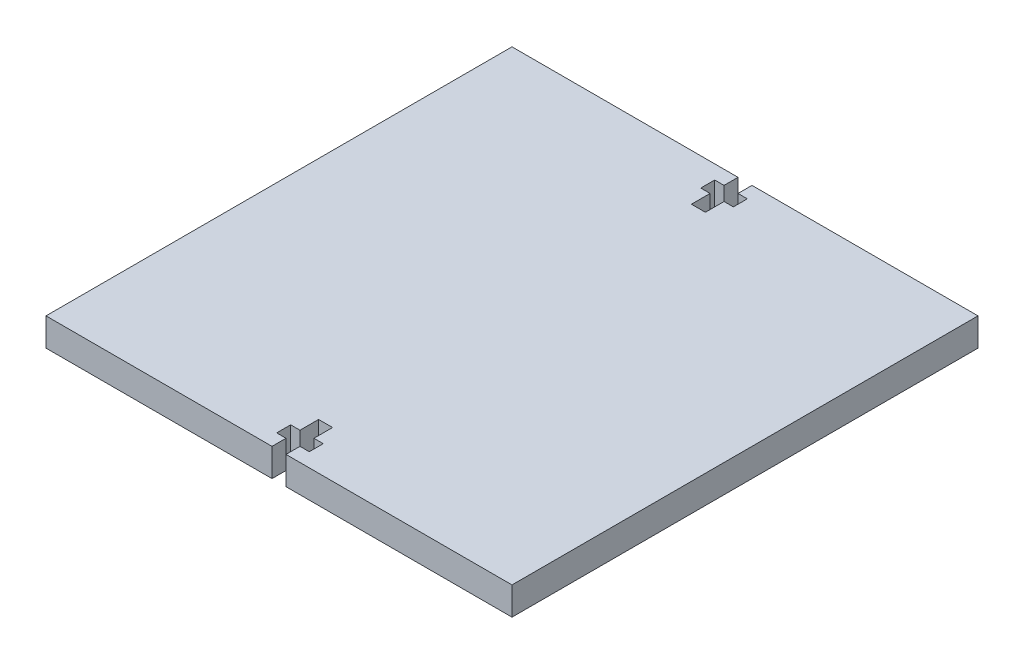
ISO-10303-21;
HEADER;
FILE_DESCRIPTION(('STEP AP214'),'2;1');
FILE_NAME('part.step','',(''),(''),'','','');
FILE_SCHEMA(('AUTOMOTIVE_DESIGN { 1 0 10303 214 1 1 1 1 }'));
ENDSEC;
DATA;
#1=APPLICATION_CONTEXT('core data for automotive mechanical design processes');
#2=APPLICATION_PROTOCOL_DEFINITION('international standard','automotive_design',2000,#1);
#3=PRODUCT_CONTEXT('',#1,'mechanical');
#4=PRODUCT('Part','Part','',(#3));
#5=PRODUCT_RELATED_PRODUCT_CATEGORY('part','',(#4));
#6=PRODUCT_DEFINITION_FORMATION('','',#4);
#7=PRODUCT_DEFINITION_CONTEXT('part definition',#1,'design');
#8=PRODUCT_DEFINITION('design','',#6,#7);
#9=PRODUCT_DEFINITION_SHAPE('','',#8);
#10=(LENGTH_UNIT() NAMED_UNIT(*) SI_UNIT(.MILLI.,.METRE.));
#11=(NAMED_UNIT(*) PLANE_ANGLE_UNIT() SI_UNIT($,.RADIAN.));
#12=(NAMED_UNIT(*) SI_UNIT($,.STERADIAN.) SOLID_ANGLE_UNIT());
#13=UNCERTAINTY_MEASURE_WITH_UNIT(LENGTH_MEASURE(1.E-05),#10,'distance_accuracy_value','');
#14=(GEOMETRIC_REPRESENTATION_CONTEXT(3) GLOBAL_UNCERTAINTY_ASSIGNED_CONTEXT((#13)) GLOBAL_UNIT_ASSIGNED_CONTEXT((#10,
#11,#12)) REPRESENTATION_CONTEXT('',''));
#15=CARTESIAN_POINT('',(0.,0.,0.));
#16=DIRECTION('',(0.,0.,1.));
#17=DIRECTION('',(1.,0.,0.));
#18=AXIS2_PLACEMENT_3D('',#15,#16,#17);
#19=CARTESIAN_POINT('',(0.,6.,0.));
#20=DIRECTION('',(0.,0.,1.));
#21=DIRECTION('',(1.,0.,0.));
#22=AXIS2_PLACEMENT_3D('',#19,#20,#21);
#23=PLANE('',#22);
#24=DIRECTION('',(0.,1.,0.));
#25=VECTOR('',#24,1.);
#26=CARTESIAN_POINT('',(-51.5,0.,0.));
#27=LINE('',#26,#25);
#28=CARTESIAN_POINT('',(-51.5,0.,0.));
#29=VERTEX_POINT('',#28);
#30=CARTESIAN_POINT('',(-51.5,6.,0.));
#31=VERTEX_POINT('',#30);
#32=EDGE_CURVE('E333',#29,#31,#27,.T.);
#33=ORIENTED_EDGE('',*,*,#32,.T.);
#34=DIRECTION('',(-1.,0.,0.));
#35=VECTOR('',#34,1.);
#36=CARTESIAN_POINT('',(0.,6.,0.));
#37=LINE('',#36,#35);
#38=CARTESIAN_POINT('',(-100.,6.,0.));
#39=VERTEX_POINT('',#38);
#40=EDGE_CURVE('E284',#31,#39,#37,.T.);
#41=ORIENTED_EDGE('',*,*,#40,.T.);
#42=DIRECTION('',(0.,-1.,0.));
#43=VECTOR('',#42,1.);
#44=CARTESIAN_POINT('',(-100.,6.,0.));
#45=LINE('',#44,#43);
#46=CARTESIAN_POINT('',(-100.,0.,0.));
#47=VERTEX_POINT('',#46);
#48=EDGE_CURVE('E11',#39,#47,#45,.T.);
#49=ORIENTED_EDGE('',*,*,#48,.T.);
#50=DIRECTION('',(-1.,0.,0.));
#51=VECTOR('',#50,1.);
#52=CARTESIAN_POINT('',(0.,0.,0.));
#53=LINE('',#52,#51);
#54=EDGE_CURVE('E260',#29,#47,#53,.T.);
#55=ORIENTED_EDGE('',*,*,#54,.F.);
#56=EDGE_LOOP('',(#33,#41,#49,#55));
#57=FACE_BOUND('',#56,.T.);
#58=ADVANCED_FACE('F39',(#57),#23,.T.);
#59=CARTESIAN_POINT('',(-100.,6.,-100.));
#60=DIRECTION('',(0.,0.,-1.));
#61=DIRECTION('',(-1.,0.,0.));
#62=AXIS2_PLACEMENT_3D('',#59,#60,#61);
#63=PLANE('',#62);
#64=DIRECTION('',(0.,1.,0.));
#65=VECTOR('',#64,1.);
#66=CARTESIAN_POINT('',(-48.5,0.,-100.));
#67=LINE('',#66,#65);
#68=CARTESIAN_POINT('',(-48.5,0.,-100.));
#69=VERTEX_POINT('',#68);
#70=CARTESIAN_POINT('',(-48.5,6.,-100.));
#71=VERTEX_POINT('',#70);
#72=EDGE_CURVE('E451',#69,#71,#67,.T.);
#73=ORIENTED_EDGE('',*,*,#72,.T.);
#74=DIRECTION('',(1.,0.,0.));
#75=VECTOR('',#74,1.);
#76=CARTESIAN_POINT('',(-100.,6.,-100.));
#77=LINE('',#76,#75);
#78=CARTESIAN_POINT('',(0.,6.,-100.));
#79=VERTEX_POINT('',#78);
#80=EDGE_CURVE('E296',#71,#79,#77,.T.);
#81=ORIENTED_EDGE('',*,*,#80,.T.);
#82=DIRECTION('',(0.,-1.,0.));
#83=VECTOR('',#82,1.);
#84=CARTESIAN_POINT('',(0.,6.,-100.));
#85=LINE('',#84,#83);
#86=CARTESIAN_POINT('',(0.,0.,-100.));
#87=VERTEX_POINT('',#86);
#88=EDGE_CURVE('E271',#79,#87,#85,.T.);
#89=ORIENTED_EDGE('',*,*,#88,.T.);
#90=DIRECTION('',(1.,0.,0.));
#91=VECTOR('',#90,1.);
#92=CARTESIAN_POINT('',(-100.,0.,-100.));
#93=LINE('',#92,#91);
#94=EDGE_CURVE('E255',#69,#87,#93,.T.);
#95=ORIENTED_EDGE('',*,*,#94,.F.);
#96=EDGE_LOOP('',(#73,#81,#89,#95));
#97=FACE_BOUND('',#96,.T.);
#98=ADVANCED_FACE('F566',(#97),#63,.T.);
#99=CARTESIAN_POINT('',(-100.,6.,0.));
#100=DIRECTION('',(-1.,0.,0.));
#101=DIRECTION('',(0.,0.,1.));
#102=AXIS2_PLACEMENT_3D('',#99,#100,#101);
#103=PLANE('',#102);
#104=DIRECTION('',(0.,0.,-1.));
#105=VECTOR('',#104,1.);
#106=CARTESIAN_POINT('',(-100.,0.,0.));
#107=LINE('',#106,#105);
#108=CARTESIAN_POINT('',(-100.,0.,-100.));
#109=VERTEX_POINT('',#108);
#110=EDGE_CURVE('E252',#47,#109,#107,.T.);
#111=ORIENTED_EDGE('',*,*,#110,.F.);
#112=ORIENTED_EDGE('',*,*,#48,.F.);
#113=DIRECTION('',(0.,0.,-1.));
#114=VECTOR('',#113,1.);
#115=CARTESIAN_POINT('',(-100.,6.,0.));
#116=LINE('',#115,#114);
#117=CARTESIAN_POINT('',(-100.,6.,-100.));
#118=VERTEX_POINT('',#117);
#119=EDGE_CURVE('E268',#39,#118,#116,.T.);
#120=ORIENTED_EDGE('',*,*,#119,.T.);
#121=DIRECTION('',(0.,-1.,0.));
#122=VECTOR('',#121,1.);
#123=CARTESIAN_POINT('',(-100.,6.,-100.));
#124=LINE('',#123,#122);
#125=EDGE_CURVE('E43',#118,#109,#124,.T.);
#126=ORIENTED_EDGE('',*,*,#125,.T.);
#127=EDGE_LOOP('',(#111,#112,#120,#126));
#128=FACE_BOUND('',#127,.T.);
#129=ADVANCED_FACE('F41',(#128),#103,.T.);
#130=DIRECTION('',(0.,1.,0.));
#131=VECTOR('',#130,1.);
#132=CARTESIAN_POINT('',(-48.5,0.,0.));
#133=LINE('',#132,#131);
#134=CARTESIAN_POINT('',(-48.5,0.,0.));
#135=VERTEX_POINT('',#134);
#136=CARTESIAN_POINT('',(-48.5,6.,0.));
#137=VERTEX_POINT('',#136);
#138=EDGE_CURVE('E299',#135,#137,#133,.T.);
#139=ORIENTED_EDGE('',*,*,#138,.F.);
#140=CARTESIAN_POINT('',(0.,0.,0.));
#141=VERTEX_POINT('',#140);
#142=EDGE_CURVE('E265',#141,#135,#53,.T.);
#143=ORIENTED_EDGE('',*,*,#142,.F.);
#144=DIRECTION('',(0.,-1.,0.));
#145=VECTOR('',#144,1.);
#146=CARTESIAN_POINT('',(0.,6.,0.));
#147=LINE('',#146,#145);
#148=CARTESIAN_POINT('',(0.,6.,0.));
#149=VERTEX_POINT('',#148);
#150=EDGE_CURVE('E49',#149,#141,#147,.T.);
#151=ORIENTED_EDGE('',*,*,#150,.F.);
#152=EDGE_CURVE('E279',#149,#137,#37,.T.);
#153=ORIENTED_EDGE('',*,*,#152,.T.);
#154=EDGE_LOOP('',(#139,#143,#151,#153));
#155=FACE_BOUND('',#154,.T.);
#156=ADVANCED_FACE('F581',(#155),#23,.T.);
#157=CARTESIAN_POINT('',(0.,6.,-100.));
#158=DIRECTION('',(1.,0.,0.));
#159=DIRECTION('',(0.,0.,-1.));
#160=AXIS2_PLACEMENT_3D('',#157,#158,#159);
#161=PLANE('',#160);
#162=DIRECTION('',(0.,0.,1.));
#163=VECTOR('',#162,1.);
#164=CARTESIAN_POINT('',(0.,0.,-100.));
#165=LINE('',#164,#163);
#166=EDGE_CURVE('E254',#87,#141,#165,.T.);
#167=ORIENTED_EDGE('',*,*,#166,.F.);
#168=ORIENTED_EDGE('',*,*,#88,.F.);
#169=DIRECTION('',(0.,0.,1.));
#170=VECTOR('',#169,1.);
#171=CARTESIAN_POINT('',(0.,6.,-100.));
#172=LINE('',#171,#170);
#173=EDGE_CURVE('E289',#79,#149,#172,.T.);
#174=ORIENTED_EDGE('',*,*,#173,.T.);
#175=ORIENTED_EDGE('',*,*,#150,.T.);
#176=EDGE_LOOP('',(#167,#168,#174,#175));
#177=FACE_BOUND('',#176,.T.);
#178=ADVANCED_FACE('F586',(#177),#161,.T.);
#179=DIRECTION('',(0.,1.,0.));
#180=VECTOR('',#179,1.);
#181=CARTESIAN_POINT('',(-51.5,0.,-100.));
#182=LINE('',#181,#180);
#183=CARTESIAN_POINT('',(-51.5,0.,-100.));
#184=VERTEX_POINT('',#183);
#185=CARTESIAN_POINT('',(-51.5,6.,-100.));
#186=VERTEX_POINT('',#185);
#187=EDGE_CURVE('E230',#184,#186,#182,.T.);
#188=ORIENTED_EDGE('',*,*,#187,.F.);
#189=EDGE_CURVE('E242',#109,#184,#93,.T.);
#190=ORIENTED_EDGE('',*,*,#189,.F.);
#191=ORIENTED_EDGE('',*,*,#125,.F.);
#192=EDGE_CURVE('E245',#118,#186,#77,.T.);
#193=ORIENTED_EDGE('',*,*,#192,.T.);
#194=EDGE_LOOP('',(#188,#190,#191,#193));
#195=FACE_BOUND('',#194,.T.);
#196=ADVANCED_FACE('F241',(#195),#63,.T.);
#197=CARTESIAN_POINT('',(0.,6.,0.));
#198=DIRECTION('',(0.,-1.,0.));
#199=DIRECTION('',(0.,0.,-1.));
#200=AXIS2_PLACEMENT_3D('',#197,#198,#199);
#201=PLANE('',#200);
#202=ORIENTED_EDGE('',*,*,#80,.F.);
#203=DIRECTION('',(0.,0.,-1.));
#204=VECTOR('',#203,1.);
#205=CARTESIAN_POINT('',(-48.5,6.,-100.));
#206=LINE('',#205,#204);
#207=CARTESIAN_POINT('',(-48.5,6.,-97.));
#208=VERTEX_POINT('',#207);
#209=EDGE_CURVE('E236',#208,#71,#206,.T.);
#210=ORIENTED_EDGE('',*,*,#209,.F.);
#211=DIRECTION('',(-1.,0.,0.));
#212=VECTOR('',#211,1.);
#213=CARTESIAN_POINT('',(-48.5,6.,-97.));
#214=LINE('',#213,#212);
#215=CARTESIAN_POINT('',(-46.5,6.,-97.));
#216=VERTEX_POINT('',#215);
#217=EDGE_CURVE('E457',#216,#208,#214,.T.);
#218=ORIENTED_EDGE('',*,*,#217,.F.);
#219=DIRECTION('',(0.,0.,-1.));
#220=VECTOR('',#219,1.);
#221=CARTESIAN_POINT('',(-46.5,6.,-97.));
#222=LINE('',#221,#220);
#223=CARTESIAN_POINT('',(-46.5,6.,-94.));
#224=VERTEX_POINT('',#223);
#225=EDGE_CURVE('E461',#224,#216,#222,.T.);
#226=ORIENTED_EDGE('',*,*,#225,.F.);
#227=DIRECTION('',(1.,0.,0.));
#228=VECTOR('',#227,1.);
#229=CARTESIAN_POINT('',(-46.5,6.,-94.));
#230=LINE('',#229,#228);
#231=CARTESIAN_POINT('',(-48.5,6.,-94.));
#232=VERTEX_POINT('',#231);
#233=EDGE_CURVE('E465',#232,#224,#230,.T.);
#234=ORIENTED_EDGE('',*,*,#233,.F.);
#235=DIRECTION('',(0.,0.,-1.));
#236=VECTOR('',#235,1.);
#237=CARTESIAN_POINT('',(-48.5,6.,-94.));
#238=LINE('',#237,#236);
#239=CARTESIAN_POINT('',(-48.5,6.,-90.));
#240=VERTEX_POINT('',#239);
#241=EDGE_CURVE('E469',#240,#232,#238,.T.);
#242=ORIENTED_EDGE('',*,*,#241,.F.);
#243=DIRECTION('',(1.,0.,0.));
#244=VECTOR('',#243,1.);
#245=CARTESIAN_POINT('',(-48.5,6.,-90.));
#246=LINE('',#245,#244);
#247=CARTESIAN_POINT('',(-51.5,6.,-90.));
#248=VERTEX_POINT('',#247);
#249=EDGE_CURVE('E473',#248,#240,#246,.T.);
#250=ORIENTED_EDGE('',*,*,#249,.F.);
#251=DIRECTION('',(0.,0.,1.));
#252=VECTOR('',#251,1.);
#253=CARTESIAN_POINT('',(-51.5,6.,-94.));
#254=LINE('',#253,#252);
#255=CARTESIAN_POINT('',(-51.5,6.,-94.));
#256=VERTEX_POINT('',#255);
#257=EDGE_CURVE('E477',#256,#248,#254,.T.);
#258=ORIENTED_EDGE('',*,*,#257,.F.);
#259=DIRECTION('',(1.,0.,0.));
#260=VECTOR('',#259,1.);
#261=CARTESIAN_POINT('',(-53.5,6.,-94.));
#262=LINE('',#261,#260);
#263=CARTESIAN_POINT('',(-53.5,6.,-94.));
#264=VERTEX_POINT('',#263);
#265=EDGE_CURVE('E481',#264,#256,#262,.T.);
#266=ORIENTED_EDGE('',*,*,#265,.F.);
#267=DIRECTION('',(0.,0.,1.));
#268=VECTOR('',#267,1.);
#269=CARTESIAN_POINT('',(-53.5,6.,-97.));
#270=LINE('',#269,#268);
#271=CARTESIAN_POINT('',(-53.5,6.,-97.));
#272=VERTEX_POINT('',#271);
#273=EDGE_CURVE('E485',#272,#264,#270,.T.);
#274=ORIENTED_EDGE('',*,*,#273,.F.);
#275=DIRECTION('',(-1.,0.,0.));
#276=VECTOR('',#275,1.);
#277=CARTESIAN_POINT('',(-51.5,6.,-97.));
#278=LINE('',#277,#276);
#279=CARTESIAN_POINT('',(-51.5,6.,-97.));
#280=VERTEX_POINT('',#279);
#281=EDGE_CURVE('E489',#280,#272,#278,.T.);
#282=ORIENTED_EDGE('',*,*,#281,.F.);
#283=DIRECTION('',(0.,0.,1.));
#284=VECTOR('',#283,1.);
#285=CARTESIAN_POINT('',(-51.5,6.,-100.));
#286=LINE('',#285,#284);
#287=EDGE_CURVE('E337',#186,#280,#286,.T.);
#288=ORIENTED_EDGE('',*,*,#287,.F.);
#289=ORIENTED_EDGE('',*,*,#192,.F.);
#290=ORIENTED_EDGE('',*,*,#119,.F.);
#291=ORIENTED_EDGE('',*,*,#40,.F.);
#292=DIRECTION('',(0.,0.,1.));
#293=VECTOR('',#292,1.);
#294=CARTESIAN_POINT('',(-51.5,6.,-2.99999999999999));
#295=LINE('',#294,#293);
#296=CARTESIAN_POINT('',(-51.5,6.,-2.99999999999999));
#297=VERTEX_POINT('',#296);
#298=EDGE_CURVE('E338',#297,#31,#295,.T.);
#299=ORIENTED_EDGE('',*,*,#298,.F.);
#300=DIRECTION('',(1.,0.,0.));
#301=VECTOR('',#300,1.);
#302=CARTESIAN_POINT('',(-53.5,6.,-2.99999999999999));
#303=LINE('',#302,#301);
#304=CARTESIAN_POINT('',(-53.5,6.,-2.99999999999999));
#305=VERTEX_POINT('',#304);
#306=EDGE_CURVE('E342',#305,#297,#303,.T.);
#307=ORIENTED_EDGE('',*,*,#306,.F.);
#308=DIRECTION('',(0.,0.,1.));
#309=VECTOR('',#308,1.);
#310=CARTESIAN_POINT('',(-53.5,6.,-5.99999999999999));
#311=LINE('',#310,#309);
#312=CARTESIAN_POINT('',(-53.5,6.,-5.99999999999999));
#313=VERTEX_POINT('',#312);
#314=EDGE_CURVE('E346',#313,#305,#311,.T.);
#315=ORIENTED_EDGE('',*,*,#314,.F.);
#316=DIRECTION('',(-1.,0.,0.));
#317=VECTOR('',#316,1.);
#318=CARTESIAN_POINT('',(-51.5,6.,-5.99999999999999));
#319=LINE('',#318,#317);
#320=CARTESIAN_POINT('',(-51.5,6.,-5.99999999999999));
#321=VERTEX_POINT('',#320);
#322=EDGE_CURVE('E350',#321,#313,#319,.T.);
#323=ORIENTED_EDGE('',*,*,#322,.F.);
#324=DIRECTION('',(0.,0.,1.));
#325=VECTOR('',#324,1.);
#326=CARTESIAN_POINT('',(-51.5,6.,-10.));
#327=LINE('',#326,#325);
#328=CARTESIAN_POINT('',(-51.5,6.,-10.));
#329=VERTEX_POINT('',#328);
#330=EDGE_CURVE('E354',#329,#321,#327,.T.);
#331=ORIENTED_EDGE('',*,*,#330,.F.);
#332=DIRECTION('',(-1.,0.,0.));
#333=VECTOR('',#332,1.);
#334=CARTESIAN_POINT('',(-50.,6.,-10.));
#335=LINE('',#334,#333);
#336=CARTESIAN_POINT('',(-48.5,6.,-9.99999999999999));
#337=VERTEX_POINT('',#336);
#338=EDGE_CURVE('E358',#337,#329,#335,.T.);
#339=ORIENTED_EDGE('',*,*,#338,.F.);
#340=DIRECTION('',(0.,0.,-1.));
#341=VECTOR('',#340,1.);
#342=CARTESIAN_POINT('',(-48.5,6.,-5.99999999999999));
#343=LINE('',#342,#341);
#344=CARTESIAN_POINT('',(-48.5,6.,-5.99999999999999));
#345=VERTEX_POINT('',#344);
#346=EDGE_CURVE('E362',#345,#337,#343,.T.);
#347=ORIENTED_EDGE('',*,*,#346,.F.);
#348=DIRECTION('',(-1.,0.,0.));
#349=VECTOR('',#348,1.);
#350=CARTESIAN_POINT('',(-46.5,6.,-5.99999999999999));
#351=LINE('',#350,#349);
#352=CARTESIAN_POINT('',(-46.5,6.,-5.99999999999999));
#353=VERTEX_POINT('',#352);
#354=EDGE_CURVE('E366',#353,#345,#351,.T.);
#355=ORIENTED_EDGE('',*,*,#354,.F.);
#356=DIRECTION('',(0.,0.,-1.));
#357=VECTOR('',#356,1.);
#358=CARTESIAN_POINT('',(-46.5,6.,-2.99999999999999));
#359=LINE('',#358,#357);
#360=CARTESIAN_POINT('',(-46.5,6.,-2.99999999999999));
#361=VERTEX_POINT('',#360);
#362=EDGE_CURVE('E370',#361,#353,#359,.T.);
#363=ORIENTED_EDGE('',*,*,#362,.F.);
#364=DIRECTION('',(1.,0.,0.));
#365=VECTOR('',#364,1.);
#366=CARTESIAN_POINT('',(-48.5,6.,-2.99999999999999));
#367=LINE('',#366,#365);
#368=CARTESIAN_POINT('',(-48.5,6.,-2.99999999999999));
#369=VERTEX_POINT('',#368);
#370=EDGE_CURVE('E374',#369,#361,#367,.T.);
#371=ORIENTED_EDGE('',*,*,#370,.F.);
#372=DIRECTION('',(0.,0.,-1.));
#373=VECTOR('',#372,1.);
#374=CARTESIAN_POINT('',(-48.5,6.,0.));
#375=LINE('',#374,#373);
#376=EDGE_CURVE('E378',#137,#369,#375,.T.);
#377=ORIENTED_EDGE('',*,*,#376,.F.);
#378=ORIENTED_EDGE('',*,*,#152,.F.);
#379=ORIENTED_EDGE('',*,*,#173,.F.);
#380=EDGE_LOOP('',(#202,#210,#218,#226,#234,#242,#250,#258,#266,#274,#282,#288,#289,#290,#291,
#299,#307,#315,#323,#331,#339,#347,#355,#363,#371,#377,#378,#379));
#381=FACE_BOUND('',#380,.T.);
#382=ADVANCED_FACE('F570',(#381),#201,.F.);
#383=CARTESIAN_POINT('',(0.,0.,0.));
#384=DIRECTION('',(0.,-1.,0.));
#385=DIRECTION('',(0.,0.,-1.));
#386=AXIS2_PLACEMENT_3D('',#383,#384,#385);
#387=PLANE('',#386);
#388=DIRECTION('',(0.,0.,-1.));
#389=VECTOR('',#388,1.);
#390=CARTESIAN_POINT('',(-48.5,0.,-100.));
#391=LINE('',#390,#389);
#392=CARTESIAN_POINT('',(-48.5,0.,-97.));
#393=VERTEX_POINT('',#392);
#394=EDGE_CURVE('E247',#393,#69,#391,.T.);
#395=ORIENTED_EDGE('',*,*,#394,.T.);
#396=ORIENTED_EDGE('',*,*,#94,.T.);
#397=ORIENTED_EDGE('',*,*,#166,.T.);
#398=ORIENTED_EDGE('',*,*,#142,.T.);
#399=DIRECTION('',(0.,0.,-1.));
#400=VECTOR('',#399,1.);
#401=CARTESIAN_POINT('',(-48.5,0.,0.));
#402=LINE('',#401,#400);
#403=CARTESIAN_POINT('',(-48.5,0.,-2.99999999999999));
#404=VERTEX_POINT('',#403);
#405=EDGE_CURVE('E341',#135,#404,#402,.T.);
#406=ORIENTED_EDGE('',*,*,#405,.T.);
#407=DIRECTION('',(1.,0.,0.));
#408=VECTOR('',#407,1.);
#409=CARTESIAN_POINT('',(-48.5,0.,-2.99999999999999));
#410=LINE('',#409,#408);
#411=CARTESIAN_POINT('',(-46.5,0.,-2.99999999999999));
#412=VERTEX_POINT('',#411);
#413=EDGE_CURVE('E65',#404,#412,#410,.T.);
#414=ORIENTED_EDGE('',*,*,#413,.T.);
#415=DIRECTION('',(0.,0.,-1.));
#416=VECTOR('',#415,1.);
#417=CARTESIAN_POINT('',(-46.5,0.,-2.99999999999999));
#418=LINE('',#417,#416);
#419=CARTESIAN_POINT('',(-46.5,0.,-5.99999999999999));
#420=VERTEX_POINT('',#419);
#421=EDGE_CURVE('E413',#412,#420,#418,.T.);
#422=ORIENTED_EDGE('',*,*,#421,.T.);
#423=DIRECTION('',(-1.,0.,0.));
#424=VECTOR('',#423,1.);
#425=CARTESIAN_POINT('',(-46.5,0.,-5.99999999999999));
#426=LINE('',#425,#424);
#427=CARTESIAN_POINT('',(-48.5,0.,-5.99999999999999));
#428=VERTEX_POINT('',#427);
#429=EDGE_CURVE('E409',#420,#428,#426,.T.);
#430=ORIENTED_EDGE('',*,*,#429,.T.);
#431=DIRECTION('',(0.,0.,-1.));
#432=VECTOR('',#431,1.);
#433=CARTESIAN_POINT('',(-48.5,0.,-5.99999999999999));
#434=LINE('',#433,#432);
#435=CARTESIAN_POINT('',(-48.5,0.,-9.99999999999999));
#436=VERTEX_POINT('',#435);
#437=EDGE_CURVE('E405',#428,#436,#434,.T.);
#438=ORIENTED_EDGE('',*,*,#437,.T.);
#439=DIRECTION('',(-1.,0.,0.));
#440=VECTOR('',#439,1.);
#441=CARTESIAN_POINT('',(-48.5,0.,-9.99999999999999));
#442=LINE('',#441,#440);
#443=CARTESIAN_POINT('',(-51.5,0.,-10.));
#444=VERTEX_POINT('',#443);
#445=EDGE_CURVE('E401',#436,#444,#442,.T.);
#446=ORIENTED_EDGE('',*,*,#445,.T.);
#447=DIRECTION('',(0.,0.,1.));
#448=VECTOR('',#447,1.);
#449=CARTESIAN_POINT('',(-51.5,0.,-10.));
#450=LINE('',#449,#448);
#451=CARTESIAN_POINT('',(-51.5,0.,-5.99999999999999));
#452=VERTEX_POINT('',#451);
#453=EDGE_CURVE('E397',#444,#452,#450,.T.);
#454=ORIENTED_EDGE('',*,*,#453,.T.);
#455=DIRECTION('',(-1.,0.,0.));
#456=VECTOR('',#455,1.);
#457=CARTESIAN_POINT('',(-51.5,0.,-5.99999999999999));
#458=LINE('',#457,#456);
#459=CARTESIAN_POINT('',(-53.5,0.,-5.99999999999999));
#460=VERTEX_POINT('',#459);
#461=EDGE_CURVE('E393',#452,#460,#458,.T.);
#462=ORIENTED_EDGE('',*,*,#461,.T.);
#463=DIRECTION('',(0.,0.,1.));
#464=VECTOR('',#463,1.);
#465=CARTESIAN_POINT('',(-53.5,0.,-5.99999999999999));
#466=LINE('',#465,#464);
#467=CARTESIAN_POINT('',(-53.5,0.,-2.99999999999999));
#468=VERTEX_POINT('',#467);
#469=EDGE_CURVE('E389',#460,#468,#466,.T.);
#470=ORIENTED_EDGE('',*,*,#469,.T.);
#471=DIRECTION('',(1.,0.,0.));
#472=VECTOR('',#471,1.);
#473=CARTESIAN_POINT('',(-53.5,0.,-2.99999999999999));
#474=LINE('',#473,#472);
#475=CARTESIAN_POINT('',(-51.5,0.,-2.99999999999999));
#476=VERTEX_POINT('',#475);
#477=EDGE_CURVE('E385',#468,#476,#474,.T.);
#478=ORIENTED_EDGE('',*,*,#477,.T.);
#479=DIRECTION('',(0.,0.,1.));
#480=VECTOR('',#479,1.);
#481=CARTESIAN_POINT('',(-51.5,0.,-2.99999999999999));
#482=LINE('',#481,#480);
#483=EDGE_CURVE('E303',#476,#29,#482,.T.);
#484=ORIENTED_EDGE('',*,*,#483,.T.);
#485=ORIENTED_EDGE('',*,*,#54,.T.);
#486=ORIENTED_EDGE('',*,*,#110,.T.);
#487=ORIENTED_EDGE('',*,*,#189,.T.);
#488=DIRECTION('',(0.,0.,1.));
#489=VECTOR('',#488,1.);
#490=CARTESIAN_POINT('',(-51.5,0.,-100.));
#491=LINE('',#490,#489);
#492=CARTESIAN_POINT('',(-51.5,0.,-97.));
#493=VERTEX_POINT('',#492);
#494=EDGE_CURVE('E226',#184,#493,#491,.T.);
#495=ORIENTED_EDGE('',*,*,#494,.T.);
#496=DIRECTION('',(-1.,0.,0.));
#497=VECTOR('',#496,1.);
#498=CARTESIAN_POINT('',(-51.5,0.,-97.));
#499=LINE('',#498,#497);
#500=CARTESIAN_POINT('',(-53.5,0.,-97.));
#501=VERTEX_POINT('',#500);
#502=EDGE_CURVE('E57',#493,#501,#499,.T.);
#503=ORIENTED_EDGE('',*,*,#502,.T.);
#504=DIRECTION('',(0.,0.,1.));
#505=VECTOR('',#504,1.);
#506=CARTESIAN_POINT('',(-53.5,0.,-97.));
#507=LINE('',#506,#505);
#508=CARTESIAN_POINT('',(-53.5,0.,-94.));
#509=VERTEX_POINT('',#508);
#510=EDGE_CURVE('E525',#501,#509,#507,.T.);
#511=ORIENTED_EDGE('',*,*,#510,.T.);
#512=DIRECTION('',(1.,0.,0.));
#513=VECTOR('',#512,1.);
#514=CARTESIAN_POINT('',(-53.5,0.,-94.));
#515=LINE('',#514,#513);
#516=CARTESIAN_POINT('',(-51.5,0.,-94.));
#517=VERTEX_POINT('',#516);
#518=EDGE_CURVE('E521',#509,#517,#515,.T.);
#519=ORIENTED_EDGE('',*,*,#518,.T.);
#520=DIRECTION('',(0.,0.,1.));
#521=VECTOR('',#520,1.);
#522=CARTESIAN_POINT('',(-51.5,0.,-94.));
#523=LINE('',#522,#521);
#524=CARTESIAN_POINT('',(-51.5,0.,-90.));
#525=VERTEX_POINT('',#524);
#526=EDGE_CURVE('E517',#517,#525,#523,.T.);
#527=ORIENTED_EDGE('',*,*,#526,.T.);
#528=DIRECTION('',(1.,0.,0.));
#529=VECTOR('',#528,1.);
#530=CARTESIAN_POINT('',(-51.5,0.,-90.));
#531=LINE('',#530,#529);
#532=CARTESIAN_POINT('',(-48.5,0.,-90.));
#533=VERTEX_POINT('',#532);
#534=EDGE_CURVE('E513',#525,#533,#531,.T.);
#535=ORIENTED_EDGE('',*,*,#534,.T.);
#536=DIRECTION('',(0.,0.,-1.));
#537=VECTOR('',#536,1.);
#538=CARTESIAN_POINT('',(-48.5,0.,-94.));
#539=LINE('',#538,#537);
#540=CARTESIAN_POINT('',(-48.5,0.,-94.));
#541=VERTEX_POINT('',#540);
#542=EDGE_CURVE('E509',#533,#541,#539,.T.);
#543=ORIENTED_EDGE('',*,*,#542,.T.);
#544=DIRECTION('',(1.,0.,0.));
#545=VECTOR('',#544,1.);
#546=CARTESIAN_POINT('',(-46.5,0.,-94.));
#547=LINE('',#546,#545);
#548=CARTESIAN_POINT('',(-46.5,0.,-94.));
#549=VERTEX_POINT('',#548);
#550=EDGE_CURVE('E505',#541,#549,#547,.T.);
#551=ORIENTED_EDGE('',*,*,#550,.T.);
#552=DIRECTION('',(0.,0.,-1.));
#553=VECTOR('',#552,1.);
#554=CARTESIAN_POINT('',(-46.5,0.,-97.));
#555=LINE('',#554,#553);
#556=CARTESIAN_POINT('',(-46.5,0.,-97.));
#557=VERTEX_POINT('',#556);
#558=EDGE_CURVE('E501',#549,#557,#555,.T.);
#559=ORIENTED_EDGE('',*,*,#558,.T.);
#560=DIRECTION('',(-1.,0.,0.));
#561=VECTOR('',#560,1.);
#562=CARTESIAN_POINT('',(-48.5,0.,-97.));
#563=LINE('',#562,#561);
#564=EDGE_CURVE('E497',#557,#393,#563,.T.);
#565=ORIENTED_EDGE('',*,*,#564,.T.);
#566=EDGE_LOOP('',(#395,#396,#397,#398,#406,#414,#422,#430,#438,#446,#454,#462,#470,#478,#484,
#485,#486,#487,#495,#503,#511,#519,#527,#535,#543,#551,#559,#565));
#567=FACE_BOUND('',#566,.T.);
#568=ADVANCED_FACE('F250',(#567),#387,.T.);
#569=CARTESIAN_POINT('',(-51.5,0.,-2.99999999999999));
#570=DIRECTION('',(-1.,0.,0.));
#571=DIRECTION('',(0.,0.,1.));
#572=AXIS2_PLACEMENT_3D('',#569,#570,#571);
#573=PLANE('',#572);
#574=ORIENTED_EDGE('',*,*,#298,.T.);
#575=ORIENTED_EDGE('',*,*,#32,.F.);
#576=ORIENTED_EDGE('',*,*,#483,.F.);
#577=DIRECTION('',(0.,1.,0.));
#578=VECTOR('',#577,1.);
#579=CARTESIAN_POINT('',(-51.5,0.,-2.99999999999999));
#580=LINE('',#579,#578);
#581=EDGE_CURVE('E330',#476,#297,#580,.T.);
#582=ORIENTED_EDGE('',*,*,#581,.T.);
#583=EDGE_LOOP('',(#574,#575,#576,#582));
#584=FACE_BOUND('',#583,.T.);
#585=ADVANCED_FACE('F603',(#584),#573,.F.);
#586=CARTESIAN_POINT('',(-53.5,0.,-2.99999999999999));
#587=DIRECTION('',(0.,0.,1.));
#588=DIRECTION('',(1.,0.,0.));
#589=AXIS2_PLACEMENT_3D('',#586,#587,#588);
#590=PLANE('',#589);
#591=ORIENTED_EDGE('',*,*,#306,.T.);
#592=ORIENTED_EDGE('',*,*,#581,.F.);
#593=ORIENTED_EDGE('',*,*,#477,.F.);
#594=DIRECTION('',(0.,1.,0.));
#595=VECTOR('',#594,1.);
#596=CARTESIAN_POINT('',(-53.5,0.,-2.99999999999999));
#597=LINE('',#596,#595);
#598=EDGE_CURVE('E327',#468,#305,#597,.T.);
#599=ORIENTED_EDGE('',*,*,#598,.T.);
#600=EDGE_LOOP('',(#591,#592,#593,#599));
#601=FACE_BOUND('',#600,.T.);
#602=ADVANCED_FACE('F639',(#601),#590,.F.);
#603=CARTESIAN_POINT('',(-53.5,0.,-5.99999999999999));
#604=DIRECTION('',(-1.,0.,0.));
#605=DIRECTION('',(0.,0.,1.));
#606=AXIS2_PLACEMENT_3D('',#603,#604,#605);
#607=PLANE('',#606);
#608=ORIENTED_EDGE('',*,*,#314,.T.);
#609=ORIENTED_EDGE('',*,*,#598,.F.);
#610=ORIENTED_EDGE('',*,*,#469,.F.);
#611=DIRECTION('',(0.,1.,0.));
#612=VECTOR('',#611,1.);
#613=CARTESIAN_POINT('',(-53.5,0.,-5.99999999999999));
#614=LINE('',#613,#612);
#615=EDGE_CURVE('E324',#460,#313,#614,.T.);
#616=ORIENTED_EDGE('',*,*,#615,.T.);
#617=EDGE_LOOP('',(#608,#609,#610,#616));
#618=FACE_BOUND('',#617,.T.);
#619=ADVANCED_FACE('F635',(#618),#607,.F.);
#620=CARTESIAN_POINT('',(-51.5,0.,-5.99999999999999));
#621=DIRECTION('',(0.,0.,-1.));
#622=DIRECTION('',(-1.,0.,0.));
#623=AXIS2_PLACEMENT_3D('',#620,#621,#622);
#624=PLANE('',#623);
#625=ORIENTED_EDGE('',*,*,#322,.T.);
#626=ORIENTED_EDGE('',*,*,#615,.F.);
#627=ORIENTED_EDGE('',*,*,#461,.F.);
#628=DIRECTION('',(0.,1.,0.));
#629=VECTOR('',#628,1.);
#630=CARTESIAN_POINT('',(-51.5,0.,-5.99999999999999));
#631=LINE('',#630,#629);
#632=EDGE_CURVE('E321',#452,#321,#631,.T.);
#633=ORIENTED_EDGE('',*,*,#632,.T.);
#634=EDGE_LOOP('',(#625,#626,#627,#633));
#635=FACE_BOUND('',#634,.T.);
#636=ADVANCED_FACE('F631',(#635),#624,.F.);
#637=CARTESIAN_POINT('',(-51.5,0.,-10.));
#638=DIRECTION('',(-1.,0.,0.));
#639=DIRECTION('',(0.,0.,1.));
#640=AXIS2_PLACEMENT_3D('',#637,#638,#639);
#641=PLANE('',#640);
#642=ORIENTED_EDGE('',*,*,#330,.T.);
#643=ORIENTED_EDGE('',*,*,#632,.F.);
#644=ORIENTED_EDGE('',*,*,#453,.F.);
#645=DIRECTION('',(0.,1.,0.));
#646=VECTOR('',#645,1.);
#647=CARTESIAN_POINT('',(-51.5,0.,-10.));
#648=LINE('',#647,#646);
#649=EDGE_CURVE('E318',#444,#329,#648,.T.);
#650=ORIENTED_EDGE('',*,*,#649,.T.);
#651=EDGE_LOOP('',(#642,#643,#644,#650));
#652=FACE_BOUND('',#651,.T.);
#653=ADVANCED_FACE('F627',(#652),#641,.F.);
#654=CARTESIAN_POINT('',(-50.,0.,-10.));
#655=DIRECTION('',(0.,0.,-1.));
#656=DIRECTION('',(-1.,0.,0.));
#657=AXIS2_PLACEMENT_3D('',#654,#655,#656);
#658=PLANE('',#657);
#659=ORIENTED_EDGE('',*,*,#338,.T.);
#660=ORIENTED_EDGE('',*,*,#649,.F.);
#661=ORIENTED_EDGE('',*,*,#445,.F.);
#662=DIRECTION('',(0.,1.,0.));
#663=VECTOR('',#662,1.);
#664=CARTESIAN_POINT('',(-48.5,0.,-9.99999999999999));
#665=LINE('',#664,#663);
#666=EDGE_CURVE('E315',#436,#337,#665,.T.);
#667=ORIENTED_EDGE('',*,*,#666,.T.);
#668=EDGE_LOOP('',(#659,#660,#661,#667));
#669=FACE_BOUND('',#668,.T.);
#670=ADVANCED_FACE('F623',(#669),#658,.F.);
#671=CARTESIAN_POINT('',(-48.5,0.,-5.99999999999999));
#672=DIRECTION('',(1.,0.,0.));
#673=DIRECTION('',(0.,0.,-1.));
#674=AXIS2_PLACEMENT_3D('',#671,#672,#673);
#675=PLANE('',#674);
#676=ORIENTED_EDGE('',*,*,#346,.T.);
#677=ORIENTED_EDGE('',*,*,#666,.F.);
#678=ORIENTED_EDGE('',*,*,#437,.F.);
#679=DIRECTION('',(0.,1.,0.));
#680=VECTOR('',#679,1.);
#681=CARTESIAN_POINT('',(-48.5,0.,-5.99999999999999));
#682=LINE('',#681,#680);
#683=EDGE_CURVE('E312',#428,#345,#682,.T.);
#684=ORIENTED_EDGE('',*,*,#683,.T.);
#685=EDGE_LOOP('',(#676,#677,#678,#684));
#686=FACE_BOUND('',#685,.T.);
#687=ADVANCED_FACE('F619',(#686),#675,.F.);
#688=CARTESIAN_POINT('',(-46.5,0.,-5.99999999999999));
#689=DIRECTION('',(0.,0.,-1.));
#690=DIRECTION('',(-1.,0.,0.));
#691=AXIS2_PLACEMENT_3D('',#688,#689,#690);
#692=PLANE('',#691);
#693=ORIENTED_EDGE('',*,*,#354,.T.);
#694=ORIENTED_EDGE('',*,*,#683,.F.);
#695=ORIENTED_EDGE('',*,*,#429,.F.);
#696=DIRECTION('',(0.,1.,0.));
#697=VECTOR('',#696,1.);
#698=CARTESIAN_POINT('',(-46.5,0.,-5.99999999999999));
#699=LINE('',#698,#697);
#700=EDGE_CURVE('E309',#420,#353,#699,.T.);
#701=ORIENTED_EDGE('',*,*,#700,.T.);
#702=EDGE_LOOP('',(#693,#694,#695,#701));
#703=FACE_BOUND('',#702,.T.);
#704=ADVANCED_FACE('F615',(#703),#692,.F.);
#705=CARTESIAN_POINT('',(-46.5,0.,-2.99999999999999));
#706=DIRECTION('',(1.,0.,0.));
#707=DIRECTION('',(0.,0.,-1.));
#708=AXIS2_PLACEMENT_3D('',#705,#706,#707);
#709=PLANE('',#708);
#710=ORIENTED_EDGE('',*,*,#362,.T.);
#711=ORIENTED_EDGE('',*,*,#700,.F.);
#712=ORIENTED_EDGE('',*,*,#421,.F.);
#713=DIRECTION('',(0.,1.,0.));
#714=VECTOR('',#713,1.);
#715=CARTESIAN_POINT('',(-46.5,0.,-2.99999999999999));
#716=LINE('',#715,#714);
#717=EDGE_CURVE('E306',#412,#361,#716,.T.);
#718=ORIENTED_EDGE('',*,*,#717,.T.);
#719=EDGE_LOOP('',(#710,#711,#712,#718));
#720=FACE_BOUND('',#719,.T.);
#721=ADVANCED_FACE('F612',(#720),#709,.F.);
#722=CARTESIAN_POINT('',(-48.5,0.,-2.99999999999999));
#723=DIRECTION('',(0.,0.,1.));
#724=DIRECTION('',(1.,0.,0.));
#725=AXIS2_PLACEMENT_3D('',#722,#723,#724);
#726=PLANE('',#725);
#727=ORIENTED_EDGE('',*,*,#370,.T.);
#728=ORIENTED_EDGE('',*,*,#717,.F.);
#729=ORIENTED_EDGE('',*,*,#413,.F.);
#730=DIRECTION('',(0.,1.,0.));
#731=VECTOR('',#730,1.);
#732=CARTESIAN_POINT('',(-48.5,0.,-2.99999999999999));
#733=LINE('',#732,#731);
#734=EDGE_CURVE('E302',#404,#369,#733,.T.);
#735=ORIENTED_EDGE('',*,*,#734,.T.);
#736=EDGE_LOOP('',(#727,#728,#729,#735));
#737=FACE_BOUND('',#736,.T.);
#738=ADVANCED_FACE('F608',(#737),#726,.F.);
#739=CARTESIAN_POINT('',(-48.5,0.,0.));
#740=DIRECTION('',(1.,0.,0.));
#741=DIRECTION('',(0.,0.,-1.));
#742=AXIS2_PLACEMENT_3D('',#739,#740,#741);
#743=PLANE('',#742);
#744=ORIENTED_EDGE('',*,*,#376,.T.);
#745=ORIENTED_EDGE('',*,*,#734,.F.);
#746=ORIENTED_EDGE('',*,*,#405,.F.);
#747=ORIENTED_EDGE('',*,*,#138,.T.);
#748=EDGE_LOOP('',(#744,#745,#746,#747));
#749=FACE_BOUND('',#748,.T.);
#750=ADVANCED_FACE('F605',(#749),#743,.F.);
#751=CARTESIAN_POINT('',(-48.5,0.,-100.));
#752=DIRECTION('',(1.,0.,0.));
#753=DIRECTION('',(0.,0.,-1.));
#754=AXIS2_PLACEMENT_3D('',#751,#752,#753);
#755=PLANE('',#754);
#756=ORIENTED_EDGE('',*,*,#209,.T.);
#757=ORIENTED_EDGE('',*,*,#72,.F.);
#758=ORIENTED_EDGE('',*,*,#394,.F.);
#759=DIRECTION('',(0.,1.,0.));
#760=VECTOR('',#759,1.);
#761=CARTESIAN_POINT('',(-48.5,0.,-97.));
#762=LINE('',#761,#760);
#763=EDGE_CURVE('E448',#393,#208,#762,.T.);
#764=ORIENTED_EDGE('',*,*,#763,.T.);
#765=EDGE_LOOP('',(#756,#757,#758,#764));
#766=FACE_BOUND('',#765,.T.);
#767=ADVANCED_FACE('F565',(#766),#755,.F.);
#768=CARTESIAN_POINT('',(-48.5,0.,-97.));
#769=DIRECTION('',(0.,0.,-1.));
#770=DIRECTION('',(-1.,0.,0.));
#771=AXIS2_PLACEMENT_3D('',#768,#769,#770);
#772=PLANE('',#771);
#773=ORIENTED_EDGE('',*,*,#217,.T.);
#774=ORIENTED_EDGE('',*,*,#763,.F.);
#775=ORIENTED_EDGE('',*,*,#564,.F.);
#776=DIRECTION('',(0.,1.,0.));
#777=VECTOR('',#776,1.);
#778=CARTESIAN_POINT('',(-46.5,0.,-97.));
#779=LINE('',#778,#777);
#780=EDGE_CURVE('E445',#557,#216,#779,.T.);
#781=ORIENTED_EDGE('',*,*,#780,.T.);
#782=EDGE_LOOP('',(#773,#774,#775,#781));
#783=FACE_BOUND('',#782,.T.);
#784=ADVANCED_FACE('F561',(#783),#772,.F.);
#785=CARTESIAN_POINT('',(-46.5,0.,-97.));
#786=DIRECTION('',(1.,0.,0.));
#787=DIRECTION('',(0.,0.,-1.));
#788=AXIS2_PLACEMENT_3D('',#785,#786,#787);
#789=PLANE('',#788);
#790=ORIENTED_EDGE('',*,*,#225,.T.);
#791=ORIENTED_EDGE('',*,*,#780,.F.);
#792=ORIENTED_EDGE('',*,*,#558,.F.);
#793=DIRECTION('',(0.,1.,0.));
#794=VECTOR('',#793,1.);
#795=CARTESIAN_POINT('',(-46.5,0.,-94.));
#796=LINE('',#795,#794);
#797=EDGE_CURVE('E442',#549,#224,#796,.T.);
#798=ORIENTED_EDGE('',*,*,#797,.T.);
#799=EDGE_LOOP('',(#790,#791,#792,#798));
#800=FACE_BOUND('',#799,.T.);
#801=ADVANCED_FACE('F557',(#800),#789,.F.);
#802=CARTESIAN_POINT('',(-46.5,0.,-94.));
#803=DIRECTION('',(0.,0.,1.));
#804=DIRECTION('',(1.,0.,0.));
#805=AXIS2_PLACEMENT_3D('',#802,#803,#804);
#806=PLANE('',#805);
#807=ORIENTED_EDGE('',*,*,#233,.T.);
#808=ORIENTED_EDGE('',*,*,#797,.F.);
#809=ORIENTED_EDGE('',*,*,#550,.F.);
#810=DIRECTION('',(0.,1.,0.));
#811=VECTOR('',#810,1.);
#812=CARTESIAN_POINT('',(-48.5,0.,-94.));
#813=LINE('',#812,#811);
#814=EDGE_CURVE('E439',#541,#232,#813,.T.);
#815=ORIENTED_EDGE('',*,*,#814,.T.);
#816=EDGE_LOOP('',(#807,#808,#809,#815));
#817=FACE_BOUND('',#816,.T.);
#818=ADVANCED_FACE('F553',(#817),#806,.F.);
#819=CARTESIAN_POINT('',(-48.5,0.,-94.));
#820=DIRECTION('',(1.,0.,0.));
#821=DIRECTION('',(0.,0.,-1.));
#822=AXIS2_PLACEMENT_3D('',#819,#820,#821);
#823=PLANE('',#822);
#824=ORIENTED_EDGE('',*,*,#241,.T.);
#825=ORIENTED_EDGE('',*,*,#814,.F.);
#826=ORIENTED_EDGE('',*,*,#542,.F.);
#827=DIRECTION('',(0.,1.,0.));
#828=VECTOR('',#827,1.);
#829=CARTESIAN_POINT('',(-48.5,0.,-90.));
#830=LINE('',#829,#828);
#831=EDGE_CURVE('E436',#533,#240,#830,.T.);
#832=ORIENTED_EDGE('',*,*,#831,.T.);
#833=EDGE_LOOP('',(#824,#825,#826,#832));
#834=FACE_BOUND('',#833,.T.);
#835=ADVANCED_FACE('F549',(#834),#823,.F.);
#836=CARTESIAN_POINT('',(-48.5,0.,-90.));
#837=DIRECTION('',(0.,0.,1.));
#838=DIRECTION('',(1.,0.,0.));
#839=AXIS2_PLACEMENT_3D('',#836,#837,#838);
#840=PLANE('',#839);
#841=ORIENTED_EDGE('',*,*,#249,.T.);
#842=ORIENTED_EDGE('',*,*,#831,.F.);
#843=ORIENTED_EDGE('',*,*,#534,.F.);
#844=DIRECTION('',(0.,1.,0.));
#845=VECTOR('',#844,1.);
#846=CARTESIAN_POINT('',(-51.5,0.,-90.));
#847=LINE('',#846,#845);
#848=EDGE_CURVE('E433',#525,#248,#847,.T.);
#849=ORIENTED_EDGE('',*,*,#848,.T.);
#850=EDGE_LOOP('',(#841,#842,#843,#849));
#851=FACE_BOUND('',#850,.T.);
#852=ADVANCED_FACE('F545',(#851),#840,.F.);
#853=CARTESIAN_POINT('',(-51.5,0.,-94.));
#854=DIRECTION('',(-1.,0.,0.));
#855=DIRECTION('',(0.,0.,1.));
#856=AXIS2_PLACEMENT_3D('',#853,#854,#855);
#857=PLANE('',#856);
#858=ORIENTED_EDGE('',*,*,#257,.T.);
#859=ORIENTED_EDGE('',*,*,#848,.F.);
#860=ORIENTED_EDGE('',*,*,#526,.F.);
#861=DIRECTION('',(0.,1.,0.));
#862=VECTOR('',#861,1.);
#863=CARTESIAN_POINT('',(-51.5,0.,-94.));
#864=LINE('',#863,#862);
#865=EDGE_CURVE('E430',#517,#256,#864,.T.);
#866=ORIENTED_EDGE('',*,*,#865,.T.);
#867=EDGE_LOOP('',(#858,#859,#860,#866));
#868=FACE_BOUND('',#867,.T.);
#869=ADVANCED_FACE('F541',(#868),#857,.F.);
#870=CARTESIAN_POINT('',(-53.5,0.,-94.));
#871=DIRECTION('',(0.,0.,1.));
#872=DIRECTION('',(1.,0.,0.));
#873=AXIS2_PLACEMENT_3D('',#870,#871,#872);
#874=PLANE('',#873);
#875=ORIENTED_EDGE('',*,*,#265,.T.);
#876=ORIENTED_EDGE('',*,*,#865,.F.);
#877=ORIENTED_EDGE('',*,*,#518,.F.);
#878=DIRECTION('',(0.,1.,0.));
#879=VECTOR('',#878,1.);
#880=CARTESIAN_POINT('',(-53.5,0.,-94.));
#881=LINE('',#880,#879);
#882=EDGE_CURVE('E427',#509,#264,#881,.T.);
#883=ORIENTED_EDGE('',*,*,#882,.T.);
#884=EDGE_LOOP('',(#875,#876,#877,#883));
#885=FACE_BOUND('',#884,.T.);
#886=ADVANCED_FACE('F537',(#885),#874,.F.);
#887=CARTESIAN_POINT('',(-53.5,0.,-97.));
#888=DIRECTION('',(-1.,0.,0.));
#889=DIRECTION('',(0.,0.,1.));
#890=AXIS2_PLACEMENT_3D('',#887,#888,#889);
#891=PLANE('',#890);
#892=ORIENTED_EDGE('',*,*,#273,.T.);
#893=ORIENTED_EDGE('',*,*,#882,.F.);
#894=ORIENTED_EDGE('',*,*,#510,.F.);
#895=DIRECTION('',(0.,1.,0.));
#896=VECTOR('',#895,1.);
#897=CARTESIAN_POINT('',(-53.5,0.,-97.));
#898=LINE('',#897,#896);
#899=EDGE_CURVE('E424',#501,#272,#898,.T.);
#900=ORIENTED_EDGE('',*,*,#899,.T.);
#901=EDGE_LOOP('',(#892,#893,#894,#900));
#902=FACE_BOUND('',#901,.T.);
#903=ADVANCED_FACE('F533',(#902),#891,.F.);
#904=CARTESIAN_POINT('',(-51.5,0.,-97.));
#905=DIRECTION('',(0.,0.,-1.));
#906=DIRECTION('',(-1.,0.,0.));
#907=AXIS2_PLACEMENT_3D('',#904,#905,#906);
#908=PLANE('',#907);
#909=ORIENTED_EDGE('',*,*,#281,.T.);
#910=ORIENTED_EDGE('',*,*,#899,.F.);
#911=ORIENTED_EDGE('',*,*,#502,.F.);
#912=DIRECTION('',(0.,1.,0.));
#913=VECTOR('',#912,1.);
#914=CARTESIAN_POINT('',(-51.5,0.,-97.));
#915=LINE('',#914,#913);
#916=EDGE_CURVE('E232',#493,#280,#915,.T.);
#917=ORIENTED_EDGE('',*,*,#916,.T.);
#918=EDGE_LOOP('',(#909,#910,#911,#917));
#919=FACE_BOUND('',#918,.T.);
#920=ADVANCED_FACE('F649',(#919),#908,.F.);
#921=CARTESIAN_POINT('',(-51.5,0.,-100.));
#922=DIRECTION('',(-1.,0.,0.));
#923=DIRECTION('',(0.,0.,1.));
#924=AXIS2_PLACEMENT_3D('',#921,#922,#923);
#925=PLANE('',#924);
#926=ORIENTED_EDGE('',*,*,#287,.T.);
#927=ORIENTED_EDGE('',*,*,#916,.F.);
#928=ORIENTED_EDGE('',*,*,#494,.F.);
#929=ORIENTED_EDGE('',*,*,#187,.T.);
#930=EDGE_LOOP('',(#926,#927,#928,#929));
#931=FACE_BOUND('',#930,.T.);
#932=ADVANCED_FACE('F229',(#931),#925,.F.);
#933=CLOSED_SHELL('',(#58,#98,#129,#156,#178,#196,#382,#568,#585,#602,#619,#636,#653,#670,#687,
#704,#721,#738,#750,#767,#784,#801,#818,#835,#852,#869,#886,#903,#920,#932));
#934=MANIFOLD_SOLID_BREP('B2',#933);
#935=ADVANCED_BREP_SHAPE_REPRESENTATION('',(#18,#934),#14);
#936=SHAPE_DEFINITION_REPRESENTATION(#9,#935);
ENDSEC;
END-ISO-10303-21;
